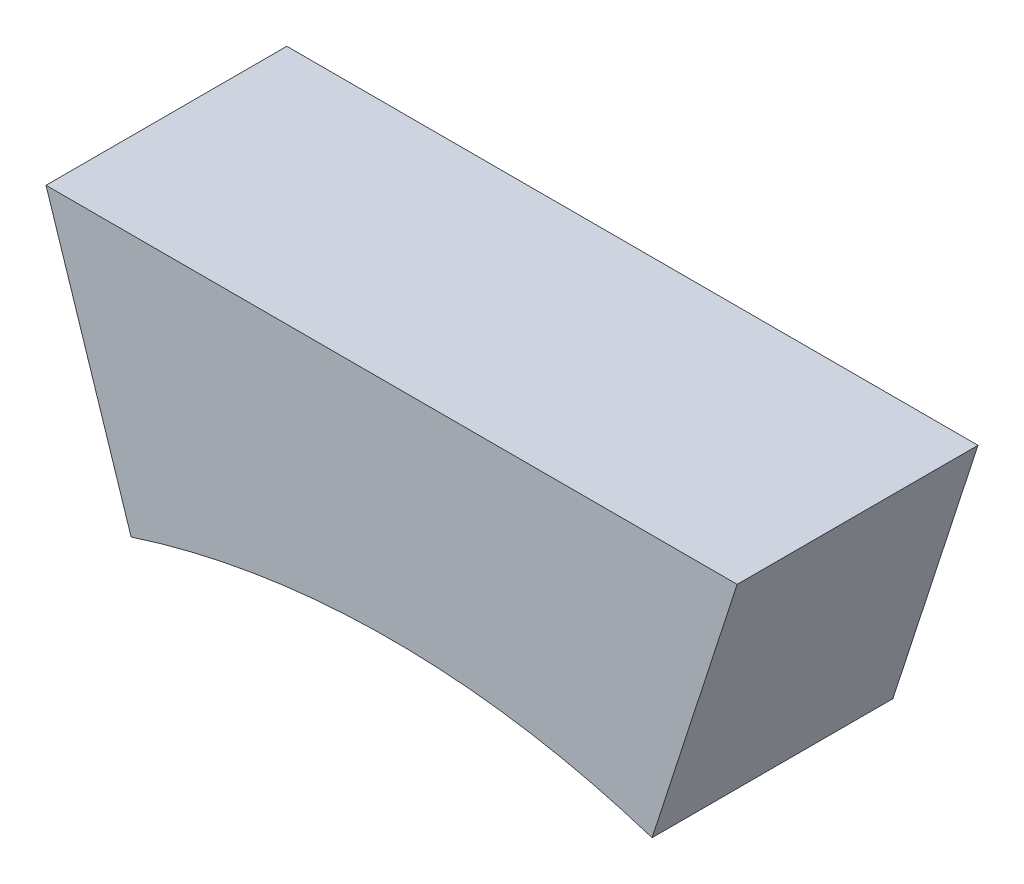
ISO-10303-21;
HEADER;
FILE_DESCRIPTION(('STEP AP214'),'2;1');
FILE_NAME('part.step','',(''),(''),'','','');
FILE_SCHEMA(('AUTOMOTIVE_DESIGN { 1 0 10303 214 1 1 1 1 }'));
ENDSEC;
DATA;
#1=APPLICATION_CONTEXT('core data for automotive mechanical design processes');
#2=APPLICATION_PROTOCOL_DEFINITION('international standard','automotive_design',2000,#1);
#3=PRODUCT_CONTEXT('',#1,'mechanical');
#4=PRODUCT('Part','Part','',(#3));
#5=PRODUCT_RELATED_PRODUCT_CATEGORY('part','',(#4));
#6=PRODUCT_DEFINITION_FORMATION('','',#4);
#7=PRODUCT_DEFINITION_CONTEXT('part definition',#1,'design');
#8=PRODUCT_DEFINITION('design','',#6,#7);
#9=PRODUCT_DEFINITION_SHAPE('','',#8);
#10=(LENGTH_UNIT() NAMED_UNIT(*) SI_UNIT(.MILLI.,.METRE.));
#11=(NAMED_UNIT(*) PLANE_ANGLE_UNIT() SI_UNIT($,.RADIAN.));
#12=(NAMED_UNIT(*) SI_UNIT($,.STERADIAN.) SOLID_ANGLE_UNIT());
#13=UNCERTAINTY_MEASURE_WITH_UNIT(LENGTH_MEASURE(1.E-05),#10,'distance_accuracy_value','');
#14=(GEOMETRIC_REPRESENTATION_CONTEXT(3) GLOBAL_UNCERTAINTY_ASSIGNED_CONTEXT((#13)) GLOBAL_UNIT_ASSIGNED_CONTEXT((#10,
#11,#12)) REPRESENTATION_CONTEXT('',''));
#15=CARTESIAN_POINT('',(0.,0.,0.));
#16=DIRECTION('',(0.,0.,1.));
#17=DIRECTION('',(1.,0.,0.));
#18=AXIS2_PLACEMENT_3D('',#15,#16,#17);
#19=CARTESIAN_POINT('',(-8112.,4992.,624.));
#20=DIRECTION('',(0.,0.,-1.));
#21=DIRECTION('',(-1.,0.,0.));
#22=AXIS2_PLACEMENT_3D('',#19,#20,#21);
#23=CYLINDRICAL_SURFACE('',#22,2184.);
#24=CARTESIAN_POINT('',(-8112.,4992.,0.));
#25=DIRECTION('',(0.,0.,1.));
#26=DIRECTION('',(1.,0.,0.));
#27=AXIS2_PLACEMENT_3D('',#24,#25,#26);
#28=CIRCLE('',#27,2184.);
#29=CARTESIAN_POINT('',(-7437.10688428511,7069.10743158861,0.));
#30=VERTEX_POINT('',#29);
#31=CARTESIAN_POINT('',(-8786.89311571488,7069.10743158862,0.));
#32=VERTEX_POINT('',#31);
#33=EDGE_CURVE('E98',#30,#32,#28,.T.);
#34=ORIENTED_EDGE('',*,*,#33,.F.);
#35=DIRECTION('',(0.,0.,-1.));
#36=VECTOR('',#35,1.);
#37=CARTESIAN_POINT('',(-7437.10688428511,7069.10743158861,624.));
#38=LINE('',#37,#36);
#39=CARTESIAN_POINT('',(-7437.10688428511,7069.10743158861,624.));
#40=VERTEX_POINT('',#39);
#41=EDGE_CURVE('E11',#40,#30,#38,.T.);
#42=ORIENTED_EDGE('',*,*,#41,.F.);
#43=CARTESIAN_POINT('',(-8112.,4992.,624.));
#44=DIRECTION('',(0.,0.,1.));
#45=DIRECTION('',(1.,0.,0.));
#46=AXIS2_PLACEMENT_3D('',#43,#44,#45);
#47=CIRCLE('',#46,2184.);
#48=CARTESIAN_POINT('',(-8786.89311571488,7069.10743158862,624.));
#49=VERTEX_POINT('',#48);
#50=EDGE_CURVE('E83',#40,#49,#47,.T.);
#51=ORIENTED_EDGE('',*,*,#50,.T.);
#52=DIRECTION('',(0.,0.,-1.));
#53=VECTOR('',#52,1.);
#54=CARTESIAN_POINT('',(-8786.89311571488,7069.10743158862,624.));
#55=LINE('',#54,#53);
#56=EDGE_CURVE('E51',#49,#32,#55,.T.);
#57=ORIENTED_EDGE('',*,*,#56,.T.);
#58=EDGE_LOOP('',(#34,#42,#51,#57));
#59=FACE_BOUND('',#58,.T.);
#60=ADVANCED_FACE('F35',(#59),#23,.F.);
#61=CARTESIAN_POINT('',(-8804.48491890676,2860.7505653382,624.));
#62=DIRECTION('',(-0.95105651629516,0.309016994374929,0.));
#63=DIRECTION('',(-0.309016994374929,-0.95105651629516,0.));
#64=AXIS2_PLACEMENT_3D('',#61,#62,#63);
#65=PLANE('',#64);
#66=DIRECTION('',(0.309016994374929,0.95105651629516,0.));
#67=VECTOR('',#66,1.);
#68=CARTESIAN_POINT('',(-8804.48491890676,2860.7505653382,0.));
#69=LINE('',#68,#67);
#70=CARTESIAN_POINT('',(-7216.52131718211,7748.,0.));
#71=VERTEX_POINT('',#70);
#72=EDGE_CURVE('E89',#30,#71,#69,.T.);
#73=ORIENTED_EDGE('',*,*,#72,.T.);
#74=DIRECTION('',(0.,0.,-1.));
#75=VECTOR('',#74,1.);
#76=CARTESIAN_POINT('',(-7216.52131718211,7748.,624.));
#77=LINE('',#76,#75);
#78=CARTESIAN_POINT('',(-7216.52131718211,7748.,624.));
#79=VERTEX_POINT('',#78);
#80=EDGE_CURVE('E43',#79,#71,#77,.T.);
#81=ORIENTED_EDGE('',*,*,#80,.F.);
#82=DIRECTION('',(0.309016994374929,0.95105651629516,0.));
#83=VECTOR('',#82,1.);
#84=CARTESIAN_POINT('',(-8804.48491890676,2860.7505653382,624.));
#85=LINE('',#84,#83);
#86=EDGE_CURVE('E77',#40,#79,#85,.T.);
#87=ORIENTED_EDGE('',*,*,#86,.F.);
#88=ORIENTED_EDGE('',*,*,#41,.T.);
#89=EDGE_LOOP('',(#73,#81,#87,#88));
#90=FACE_BOUND('',#89,.T.);
#91=ADVANCED_FACE('F87',(#90),#65,.F.);
#92=CARTESIAN_POINT('',(0.,7748.,624.));
#93=DIRECTION('',(0.,-1.,0.));
#94=DIRECTION('',(0.,0.,-1.));
#95=AXIS2_PLACEMENT_3D('',#92,#93,#94);
#96=PLANE('',#95);
#97=DIRECTION('',(-1.,0.,0.));
#98=VECTOR('',#97,1.);
#99=CARTESIAN_POINT('',(0.,7748.,0.));
#100=LINE('',#99,#98);
#101=CARTESIAN_POINT('',(-9007.47868281789,7748.,0.));
#102=VERTEX_POINT('',#101);
#103=EDGE_CURVE('E101',#71,#102,#100,.T.);
#104=ORIENTED_EDGE('',*,*,#103,.T.);
#105=DIRECTION('',(0.,0.,-1.));
#106=VECTOR('',#105,1.);
#107=CARTESIAN_POINT('',(-9007.47868281789,7748.,624.));
#108=LINE('',#107,#106);
#109=CARTESIAN_POINT('',(-9007.47868281789,7748.,624.));
#110=VERTEX_POINT('',#109);
#111=EDGE_CURVE('E65',#110,#102,#108,.T.);
#112=ORIENTED_EDGE('',*,*,#111,.F.);
#113=DIRECTION('',(-1.,0.,0.));
#114=VECTOR('',#113,1.);
#115=CARTESIAN_POINT('',(0.,7748.,624.));
#116=LINE('',#115,#114);
#117=EDGE_CURVE('E82',#79,#110,#116,.T.);
#118=ORIENTED_EDGE('',*,*,#117,.F.);
#119=ORIENTED_EDGE('',*,*,#80,.T.);
#120=EDGE_LOOP('',(#104,#112,#118,#119));
#121=FACE_BOUND('',#120,.T.);
#122=ADVANCED_FACE('F92',(#121),#96,.F.);
#123=CARTESIAN_POINT('',(-5870.2609394628,-1907.36340125813,624.));
#124=DIRECTION('',(-0.951056516295155,-0.309016994374945,0.));
#125=DIRECTION('',(0.309016994374945,-0.951056516295155,0.));
#126=AXIS2_PLACEMENT_3D('',#123,#124,#125);
#127=PLANE('',#126);
#128=DIRECTION('',(-0.309016994374945,0.951056516295154,0.));
#129=VECTOR('',#128,1.);
#130=CARTESIAN_POINT('',(-5870.2609394628,-1907.36340125813,0.));
#131=LINE('',#130,#129);
#132=EDGE_CURVE('E103',#32,#102,#131,.T.);
#133=ORIENTED_EDGE('',*,*,#132,.F.);
#134=ORIENTED_EDGE('',*,*,#56,.F.);
#135=DIRECTION('',(-0.309016994374945,0.951056516295154,0.));
#136=VECTOR('',#135,1.);
#137=CARTESIAN_POINT('',(-5870.2609394628,-1907.36340125813,624.));
#138=LINE('',#137,#136);
#139=EDGE_CURVE('E93',#49,#110,#138,.T.);
#140=ORIENTED_EDGE('',*,*,#139,.T.);
#141=ORIENTED_EDGE('',*,*,#111,.T.);
#142=EDGE_LOOP('',(#133,#134,#140,#141));
#143=FACE_BOUND('',#142,.T.);
#144=ADVANCED_FACE('F108',(#143),#127,.T.);
#145=CARTESIAN_POINT('',(0.,0.,624.));
#146=DIRECTION('',(0.,0.,1.));
#147=DIRECTION('',(1.,0.,0.));
#148=AXIS2_PLACEMENT_3D('',#145,#146,#147);
#149=PLANE('',#148);
#150=ORIENTED_EDGE('',*,*,#50,.F.);
#151=ORIENTED_EDGE('',*,*,#86,.T.);
#152=ORIENTED_EDGE('',*,*,#117,.T.);
#153=ORIENTED_EDGE('',*,*,#139,.F.);
#154=EDGE_LOOP('',(#150,#151,#152,#153));
#155=FACE_BOUND('',#154,.T.);
#156=ADVANCED_FACE('F79',(#155),#149,.T.);
#157=CARTESIAN_POINT('',(0.,0.,0.));
#158=DIRECTION('',(0.,0.,1.));
#159=DIRECTION('',(1.,0.,0.));
#160=AXIS2_PLACEMENT_3D('',#157,#158,#159);
#161=PLANE('',#160);
#162=ORIENTED_EDGE('',*,*,#33,.T.);
#163=ORIENTED_EDGE('',*,*,#132,.T.);
#164=ORIENTED_EDGE('',*,*,#103,.F.);
#165=ORIENTED_EDGE('',*,*,#72,.F.);
#166=EDGE_LOOP('',(#162,#163,#164,#165));
#167=FACE_BOUND('',#166,.T.);
#168=ADVANCED_FACE('F115',(#167),#161,.F.);
#169=CLOSED_SHELL('',(#60,#91,#122,#144,#156,#168));
#170=MANIFOLD_SOLID_BREP('B2',#169);
#171=ADVANCED_BREP_SHAPE_REPRESENTATION('',(#18,#170),#14);
#172=SHAPE_DEFINITION_REPRESENTATION(#9,#171);
ENDSEC;
END-ISO-10303-21;
